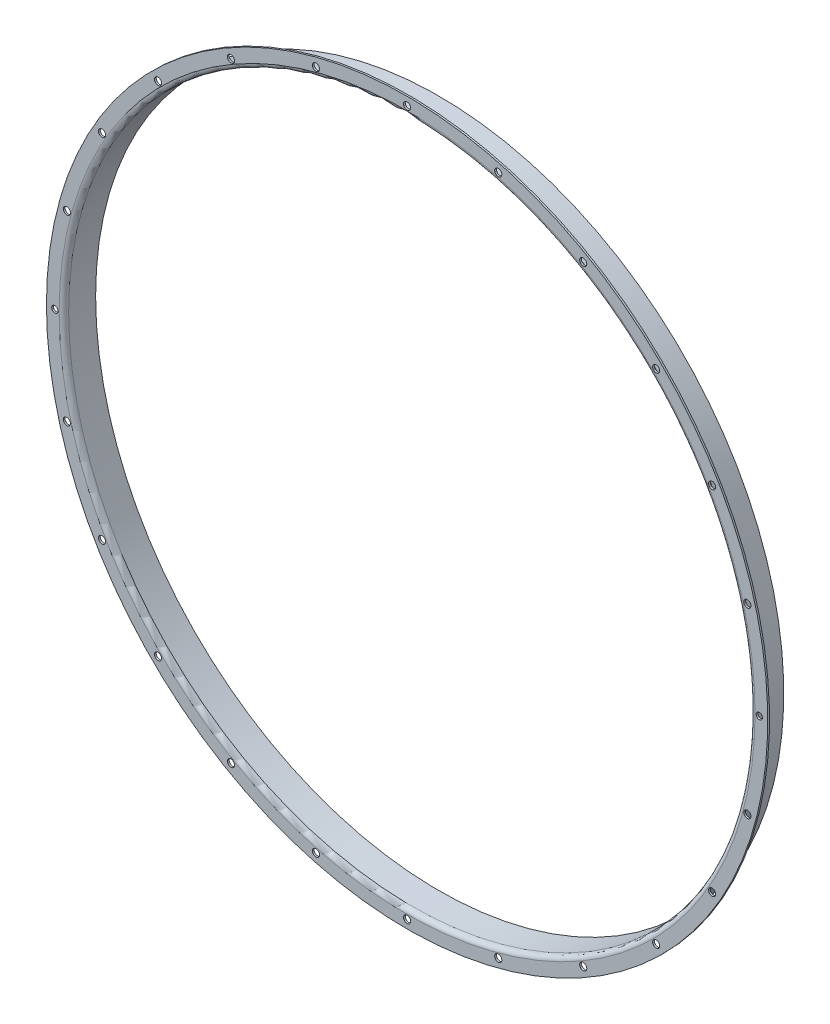
ISO-10303-21;
HEADER;
FILE_DESCRIPTION(('STEP AP214'),'2;1');
FILE_NAME('part.step','',(''),(''),'','','');
FILE_SCHEMA(('AUTOMOTIVE_DESIGN { 1 0 10303 214 1 1 1 1 }'));
ENDSEC;
DATA;
#1=APPLICATION_CONTEXT('core data for automotive mechanical design processes');
#2=APPLICATION_PROTOCOL_DEFINITION('international standard','automotive_design',2000,#1);
#3=PRODUCT_CONTEXT('',#1,'mechanical');
#4=PRODUCT('Part','Part','',(#3));
#5=PRODUCT_RELATED_PRODUCT_CATEGORY('part','',(#4));
#6=PRODUCT_DEFINITION_FORMATION('','',#4);
#7=PRODUCT_DEFINITION_CONTEXT('part definition',#1,'design');
#8=PRODUCT_DEFINITION('design','',#6,#7);
#9=PRODUCT_DEFINITION_SHAPE('','',#8);
#10=(LENGTH_UNIT() NAMED_UNIT(*) SI_UNIT(.MILLI.,.METRE.));
#11=(NAMED_UNIT(*) PLANE_ANGLE_UNIT() SI_UNIT($,.RADIAN.));
#12=(NAMED_UNIT(*) SI_UNIT($,.STERADIAN.) SOLID_ANGLE_UNIT());
#13=UNCERTAINTY_MEASURE_WITH_UNIT(LENGTH_MEASURE(1.E-05),#10,'distance_accuracy_value','');
#14=(GEOMETRIC_REPRESENTATION_CONTEXT(3) GLOBAL_UNCERTAINTY_ASSIGNED_CONTEXT((#13)) GLOBAL_UNIT_ASSIGNED_CONTEXT((#10,
#11,#12)) REPRESENTATION_CONTEXT('',''));
#15=CARTESIAN_POINT('',(0.,0.,0.));
#16=DIRECTION('',(0.,0.,1.));
#17=DIRECTION('',(1.,0.,0.));
#18=AXIS2_PLACEMENT_3D('',#15,#16,#17);
#19=CARTESIAN_POINT('',(0.,0.,0.));
#20=DIRECTION('',(0.,0.,-1.));
#21=DIRECTION('',(-1.,0.,0.));
#22=AXIS2_PLACEMENT_3D('',#19,#20,#21);
#23=CYLINDRICAL_SURFACE('',#22,227.325);
#24=CARTESIAN_POINT('',(0.,0.,0.));
#25=DIRECTION('',(0.,0.,-1.));
#26=DIRECTION('',(-1.,0.,0.));
#27=AXIS2_PLACEMENT_3D('',#24,#25,#26);
#28=CIRCLE('',#27,227.325);
#29=CARTESIAN_POINT('',(-227.325,0.,0.));
#30=VERTEX_POINT('',#29);
#31=EDGE_CURVE('E62',#30,#30,#28,.T.);
#32=ORIENTED_EDGE('',*,*,#31,.T.);
#33=EDGE_LOOP('',(#32));
#34=FACE_BOUND('',#33,.T.);
#35=CARTESIAN_POINT('',(0.,0.,-1.1));
#36=DIRECTION('',(0.,0.,-1.));
#37=DIRECTION('',(-1.,0.,0.));
#38=AXIS2_PLACEMENT_3D('',#35,#36,#37);
#39=CIRCLE('',#38,227.325);
#40=CARTESIAN_POINT('',(-227.325,0.,-1.1));
#41=VERTEX_POINT('',#40);
#42=EDGE_CURVE('E10',#41,#41,#39,.T.);
#43=ORIENTED_EDGE('',*,*,#42,.F.);
#44=EDGE_LOOP('',(#43));
#45=FACE_BOUND('',#44,.T.);
#46=ADVANCED_FACE('F34',(#34,#45),#23,.T.);
#47=CARTESIAN_POINT('',(0.,219.425,-1.1));
#48=DIRECTION('',(0.,0.,-1.));
#49=DIRECTION('',(-1.,0.,0.));
#50=AXIS2_PLACEMENT_3D('',#47,#48,#49);
#51=PLANE('',#50);
#52=CARTESIAN_POINT('',(57.4578280127567,214.435533436174,-1.1));
#53=DIRECTION('',(0.,0.,-1.));
#54=DIRECTION('',(-1.,0.,0.));
#55=AXIS2_PLACEMENT_3D('',#52,#53,#54);
#56=CIRCLE('',#55,2.25);
#57=CARTESIAN_POINT('',(55.2078280127567,214.435533436174,-1.1));
#58=VERTEX_POINT('',#57);
#59=EDGE_CURVE('E191',#58,#58,#56,.T.);
#60=ORIENTED_EDGE('',*,*,#59,.F.);
#61=EDGE_LOOP('',(#60));
#62=FACE_BOUND('',#61,.T.);
#63=CARTESIAN_POINT('',(110.999999999998,192.257639640147,-1.1));
#64=DIRECTION('',(0.,0.,-1.));
#65=DIRECTION('',(-1.,0.,0.));
#66=AXIS2_PLACEMENT_3D('',#63,#64,#65);
#67=CIRCLE('',#66,2.25);
#68=CARTESIAN_POINT('',(108.749999999998,192.257639640147,-1.1));
#69=VERTEX_POINT('',#68);
#70=EDGE_CURVE('E185',#69,#69,#67,.T.);
#71=ORIENTED_EDGE('',*,*,#70,.F.);
#72=EDGE_LOOP('',(#71));
#73=FACE_BOUND('',#72,.T.);
#74=CARTESIAN_POINT('',(156.977705423412,156.977705423415,-1.1));
#75=DIRECTION('',(0.,0.,-1.));
#76=DIRECTION('',(-1.,0.,0.));
#77=AXIS2_PLACEMENT_3D('',#74,#75,#76);
#78=CIRCLE('',#77,2.25);
#79=CARTESIAN_POINT('',(154.727705423412,156.977705423415,-1.1));
#80=VERTEX_POINT('',#79);
#81=EDGE_CURVE('E179',#80,#80,#78,.T.);
#82=ORIENTED_EDGE('',*,*,#81,.F.);
#83=EDGE_LOOP('',(#82));
#84=FACE_BOUND('',#83,.T.);
#85=CARTESIAN_POINT('',(192.257639640144,111.000000000002,-1.1));
#86=DIRECTION('',(0.,0.,-1.));
#87=DIRECTION('',(-1.,0.,0.));
#88=AXIS2_PLACEMENT_3D('',#85,#86,#87);
#89=CIRCLE('',#88,2.25);
#90=CARTESIAN_POINT('',(190.007639640144,111.000000000002,-1.1));
#91=VERTEX_POINT('',#90);
#92=EDGE_CURVE('E173',#91,#91,#89,.T.);
#93=ORIENTED_EDGE('',*,*,#92,.F.);
#94=EDGE_LOOP('',(#93));
#95=FACE_BOUND('',#94,.T.);
#96=CARTESIAN_POINT('',(214.435533436173,57.457828012762,-1.1));
#97=DIRECTION('',(0.,0.,-1.));
#98=DIRECTION('',(-1.,0.,0.));
#99=AXIS2_PLACEMENT_3D('',#96,#97,#98);
#100=CIRCLE('',#99,2.25);
#101=CARTESIAN_POINT('',(212.185533436173,57.457828012762,-1.1));
#102=VERTEX_POINT('',#101);
#103=EDGE_CURVE('E167',#102,#102,#100,.T.);
#104=ORIENTED_EDGE('',*,*,#103,.F.);
#105=EDGE_LOOP('',(#104));
#106=FACE_BOUND('',#105,.T.);
#107=CARTESIAN_POINT('',(214.435533436174,-57.4578280127575,-1.1));
#108=DIRECTION('',(0.,0.,-1.));
#109=DIRECTION('',(-1.,0.,0.));
#110=AXIS2_PLACEMENT_3D('',#107,#108,#109);
#111=CIRCLE('',#110,2.25);
#112=CARTESIAN_POINT('',(212.185533436174,-57.4578280127575,-1.1));
#113=VERTEX_POINT('',#112);
#114=EDGE_CURVE('E161',#113,#113,#111,.T.);
#115=ORIENTED_EDGE('',*,*,#114,.F.);
#116=EDGE_LOOP('',(#115));
#117=FACE_BOUND('',#116,.T.);
#118=CARTESIAN_POINT('',(192.257639640146,-110.999999999998,-1.1));
#119=DIRECTION('',(0.,0.,-1.));
#120=DIRECTION('',(-1.,0.,0.));
#121=AXIS2_PLACEMENT_3D('',#118,#119,#120);
#122=CIRCLE('',#121,2.25);
#123=CARTESIAN_POINT('',(190.007639640146,-110.999999999998,-1.1));
#124=VERTEX_POINT('',#123);
#125=EDGE_CURVE('E155',#124,#124,#122,.T.);
#126=ORIENTED_EDGE('',*,*,#125,.F.);
#127=EDGE_LOOP('',(#126));
#128=FACE_BOUND('',#127,.T.);
#129=CARTESIAN_POINT('',(156.977705423415,-156.977705423412,-1.1));
#130=DIRECTION('',(0.,0.,-1.));
#131=DIRECTION('',(-1.,0.,0.));
#132=AXIS2_PLACEMENT_3D('',#129,#130,#131);
#133=CIRCLE('',#132,2.25);
#134=CARTESIAN_POINT('',(154.727705423415,-156.977705423412,-1.1));
#135=VERTEX_POINT('',#134);
#136=EDGE_CURVE('E149',#135,#135,#133,.T.);
#137=ORIENTED_EDGE('',*,*,#136,.F.);
#138=EDGE_LOOP('',(#137));
#139=FACE_BOUND('',#138,.T.);
#140=CARTESIAN_POINT('',(111.000000000002,-192.257639640144,-1.1));
#141=DIRECTION('',(0.,0.,-1.));
#142=DIRECTION('',(-1.,0.,0.));
#143=AXIS2_PLACEMENT_3D('',#140,#141,#142);
#144=CIRCLE('',#143,2.25);
#145=CARTESIAN_POINT('',(108.750000000002,-192.257639640144,-1.1));
#146=VERTEX_POINT('',#145);
#147=EDGE_CURVE('E143',#146,#146,#144,.T.);
#148=ORIENTED_EDGE('',*,*,#147,.F.);
#149=EDGE_LOOP('',(#148));
#150=FACE_BOUND('',#149,.T.);
#151=CARTESIAN_POINT('',(57.4578280127612,-214.435533436173,-1.1));
#152=DIRECTION('',(0.,0.,-1.));
#153=DIRECTION('',(-1.,0.,0.));
#154=AXIS2_PLACEMENT_3D('',#151,#152,#153);
#155=CIRCLE('',#154,2.25);
#156=CARTESIAN_POINT('',(55.2078280127612,-214.435533436173,-1.1));
#157=VERTEX_POINT('',#156);
#158=EDGE_CURVE('E137',#157,#157,#155,.T.);
#159=ORIENTED_EDGE('',*,*,#158,.F.);
#160=EDGE_LOOP('',(#159));
#161=FACE_BOUND('',#160,.T.);
#162=CARTESIAN_POINT('',(0.,-222.,-1.1));
#163=DIRECTION('',(0.,0.,-1.));
#164=DIRECTION('',(-1.,0.,0.));
#165=AXIS2_PLACEMENT_3D('',#162,#163,#164);
#166=CIRCLE('',#165,2.25);
#167=CARTESIAN_POINT('',(-2.25,-222.,-1.1));
#168=VERTEX_POINT('',#167);
#169=EDGE_CURVE('E131',#168,#168,#166,.T.);
#170=ORIENTED_EDGE('',*,*,#169,.F.);
#171=EDGE_LOOP('',(#170));
#172=FACE_BOUND('',#171,.T.);
#173=CARTESIAN_POINT('',(-57.4578280127582,-214.435533436174,-1.1));
#174=DIRECTION('',(0.,0.,-1.));
#175=DIRECTION('',(-1.,0.,0.));
#176=AXIS2_PLACEMENT_3D('',#173,#174,#175);
#177=CIRCLE('',#176,2.25);
#178=CARTESIAN_POINT('',(-59.7078280127582,-214.435533436174,-1.1));
#179=VERTEX_POINT('',#178);
#180=EDGE_CURVE('E125',#179,#179,#177,.T.);
#181=ORIENTED_EDGE('',*,*,#180,.F.);
#182=EDGE_LOOP('',(#181));
#183=FACE_BOUND('',#182,.T.);
#184=CARTESIAN_POINT('',(-110.999999999999,-192.257639640146,-1.1));
#185=DIRECTION('',(0.,0.,-1.));
#186=DIRECTION('',(-1.,0.,0.));
#187=AXIS2_PLACEMENT_3D('',#184,#185,#186);
#188=CIRCLE('',#187,2.25);
#189=CARTESIAN_POINT('',(-113.249999999999,-192.257639640146,-1.1));
#190=VERTEX_POINT('',#189);
#191=EDGE_CURVE('E119',#190,#190,#188,.T.);
#192=ORIENTED_EDGE('',*,*,#191,.F.);
#193=EDGE_LOOP('',(#192));
#194=FACE_BOUND('',#193,.T.);
#195=CARTESIAN_POINT('',(-156.977705423413,-156.977705423414,-1.1));
#196=DIRECTION('',(0.,0.,-1.));
#197=DIRECTION('',(-1.,0.,0.));
#198=AXIS2_PLACEMENT_3D('',#195,#196,#197);
#199=CIRCLE('',#198,2.25);
#200=CARTESIAN_POINT('',(-159.227705423413,-156.977705423414,-1.1));
#201=VERTEX_POINT('',#200);
#202=EDGE_CURVE('E113',#201,#201,#199,.T.);
#203=ORIENTED_EDGE('',*,*,#202,.F.);
#204=EDGE_LOOP('',(#203));
#205=FACE_BOUND('',#204,.T.);
#206=CARTESIAN_POINT('',(-192.257639640145,-111.000000000001,-1.1));
#207=DIRECTION('',(0.,0.,-1.));
#208=DIRECTION('',(-1.,0.,0.));
#209=AXIS2_PLACEMENT_3D('',#206,#207,#208);
#210=CIRCLE('',#209,2.25);
#211=CARTESIAN_POINT('',(-194.507639640145,-111.000000000001,-1.1));
#212=VERTEX_POINT('',#211);
#213=EDGE_CURVE('E107',#212,#212,#210,.T.);
#214=ORIENTED_EDGE('',*,*,#213,.F.);
#215=EDGE_LOOP('',(#214));
#216=FACE_BOUND('',#215,.T.);
#217=CARTESIAN_POINT('',(-214.435533436173,-57.4578280127605,-1.1));
#218=DIRECTION('',(0.,0.,-1.));
#219=DIRECTION('',(-1.,0.,0.));
#220=AXIS2_PLACEMENT_3D('',#217,#218,#219);
#221=CIRCLE('',#220,2.25);
#222=CARTESIAN_POINT('',(-216.685533436173,-57.4578280127605,-1.1));
#223=VERTEX_POINT('',#222);
#224=EDGE_CURVE('E101',#223,#223,#221,.T.);
#225=ORIENTED_EDGE('',*,*,#224,.F.);
#226=EDGE_LOOP('',(#225));
#227=FACE_BOUND('',#226,.T.);
#228=CARTESIAN_POINT('',(-214.435533436173,57.457828012759,-1.1));
#229=DIRECTION('',(0.,0.,-1.));
#230=DIRECTION('',(-1.,0.,0.));
#231=AXIS2_PLACEMENT_3D('',#228,#229,#230);
#232=CIRCLE('',#231,2.25);
#233=CARTESIAN_POINT('',(-216.685533436173,57.457828012759,-1.1));
#234=VERTEX_POINT('',#233);
#235=EDGE_CURVE('E95',#234,#234,#232,.T.);
#236=ORIENTED_EDGE('',*,*,#235,.F.);
#237=EDGE_LOOP('',(#236));
#238=FACE_BOUND('',#237,.T.);
#239=CARTESIAN_POINT('',(-192.257639640146,111.,-1.1));
#240=DIRECTION('',(0.,0.,-1.));
#241=DIRECTION('',(-1.,0.,0.));
#242=AXIS2_PLACEMENT_3D('',#239,#240,#241);
#243=CIRCLE('',#242,2.25);
#244=CARTESIAN_POINT('',(-194.507639640146,111.,-1.1));
#245=VERTEX_POINT('',#244);
#246=EDGE_CURVE('E89',#245,#245,#243,.T.);
#247=ORIENTED_EDGE('',*,*,#246,.F.);
#248=EDGE_LOOP('',(#247));
#249=FACE_BOUND('',#248,.T.);
#250=CARTESIAN_POINT('',(-156.977705423414,156.977705423413,-1.1));
#251=DIRECTION('',(0.,0.,-1.));
#252=DIRECTION('',(-1.,0.,0.));
#253=AXIS2_PLACEMENT_3D('',#250,#251,#252);
#254=CIRCLE('',#253,2.25);
#255=CARTESIAN_POINT('',(-159.227705423414,156.977705423413,-1.1));
#256=VERTEX_POINT('',#255);
#257=EDGE_CURVE('E83',#256,#256,#254,.T.);
#258=ORIENTED_EDGE('',*,*,#257,.F.);
#259=EDGE_LOOP('',(#258));
#260=FACE_BOUND('',#259,.T.);
#261=CARTESIAN_POINT('',(-111.,192.257639640145,-1.1));
#262=DIRECTION('',(0.,0.,-1.));
#263=DIRECTION('',(-1.,0.,0.));
#264=AXIS2_PLACEMENT_3D('',#261,#262,#263);
#265=CIRCLE('',#264,2.25);
#266=CARTESIAN_POINT('',(-113.25,192.257639640145,-1.1));
#267=VERTEX_POINT('',#266);
#268=EDGE_CURVE('E77',#267,#267,#265,.T.);
#269=ORIENTED_EDGE('',*,*,#268,.F.);
#270=EDGE_LOOP('',(#269));
#271=FACE_BOUND('',#270,.T.);
#272=CARTESIAN_POINT('',(-57.4578280127597,214.435533436173,-1.1));
#273=DIRECTION('',(0.,0.,-1.));
#274=DIRECTION('',(-1.,0.,0.));
#275=AXIS2_PLACEMENT_3D('',#272,#273,#274);
#276=CIRCLE('',#275,2.25);
#277=CARTESIAN_POINT('',(-59.7078280127597,214.435533436173,-1.1));
#278=VERTEX_POINT('',#277);
#279=EDGE_CURVE('E71',#278,#278,#276,.T.);
#280=ORIENTED_EDGE('',*,*,#279,.F.);
#281=EDGE_LOOP('',(#280));
#282=FACE_BOUND('',#281,.T.);
#283=CARTESIAN_POINT('',(0.,222.,-1.1));
#284=DIRECTION('',(0.,0.,-1.));
#285=DIRECTION('',(-1.,0.,0.));
#286=AXIS2_PLACEMENT_3D('',#283,#284,#285);
#287=CIRCLE('',#286,2.25);
#288=CARTESIAN_POINT('',(-2.25,222.,-1.1));
#289=VERTEX_POINT('',#288);
#290=EDGE_CURVE('E65',#289,#289,#287,.T.);
#291=ORIENTED_EDGE('',*,*,#290,.F.);
#292=EDGE_LOOP('',(#291));
#293=FACE_BOUND('',#292,.T.);
#294=ORIENTED_EDGE('',*,*,#42,.T.);
#295=EDGE_LOOP('',(#294));
#296=FACE_BOUND('',#295,.T.);
#297=CARTESIAN_POINT('',(0.,0.,-1.1));
#298=DIRECTION('',(0.,0.,-1.));
#299=DIRECTION('',(-1.,0.,0.));
#300=AXIS2_PLACEMENT_3D('',#297,#298,#299);
#301=CIRCLE('',#300,219.425);
#302=CARTESIAN_POINT('',(-219.425,0.,-1.1));
#303=VERTEX_POINT('',#302);
#304=EDGE_CURVE('E40',#303,#303,#301,.T.);
#305=ORIENTED_EDGE('',*,*,#304,.F.);
#306=EDGE_LOOP('',(#305));
#307=FACE_BOUND('',#306,.T.);
#308=CARTESIAN_POINT('',(-222.,-7.74891763399207E-13,-1.1));
#309=DIRECTION('',(0.,0.,-1.));
#310=DIRECTION('',(-1.,0.,0.));
#311=AXIS2_PLACEMENT_3D('',#308,#309,#310);
#312=CIRCLE('',#311,2.);
#313=CARTESIAN_POINT('',(-224.,-7.74891763399207E-13,-1.1));
#314=VERTEX_POINT('',#313);
#315=EDGE_CURVE('E197',#314,#314,#312,.F.);
#316=ORIENTED_EDGE('',*,*,#315,.T.);
#317=EDGE_LOOP('',(#316));
#318=FACE_BOUND('',#317,.T.);
#319=CARTESIAN_POINT('',(222.,2.32510947784556E-12,-1.1));
#320=DIRECTION('',(0.,0.,-1.));
#321=DIRECTION('',(-1.,0.,0.));
#322=AXIS2_PLACEMENT_3D('',#319,#320,#321);
#323=CIRCLE('',#322,2.);
#324=CARTESIAN_POINT('',(220.,2.32510947784556E-12,-1.1));
#325=VERTEX_POINT('',#324);
#326=EDGE_CURVE('E203',#325,#325,#323,.F.);
#327=ORIENTED_EDGE('',*,*,#326,.T.);
#328=EDGE_LOOP('',(#327));
#329=FACE_BOUND('',#328,.T.);
#330=ADVANCED_FACE('F232',(#62,#73,#84,#95,#106,#117,#128,#139,#150,#161,#172,#183,#194,#205,
#216,#227,#238,#249,#260,#271,#282,#293,#296,#307,#318,#329),#51,.T.);
#331=CARTESIAN_POINT('',(0.,0.,-3.1));
#332=DIRECTION('',(0.,0.,-1.));
#333=DIRECTION('',(-1.,0.,0.));
#334=AXIS2_PLACEMENT_3D('',#331,#332,#333);
#335=TOROIDAL_SURFACE('',#334,219.425,2.);
#336=ORIENTED_EDGE('',*,*,#304,.T.);
#337=EDGE_LOOP('',(#336));
#338=FACE_BOUND('',#337,.T.);
#339=CARTESIAN_POINT('',(0.,0.,-3.1));
#340=DIRECTION('',(0.,0.,-1.));
#341=DIRECTION('',(-1.,0.,0.));
#342=AXIS2_PLACEMENT_3D('',#339,#340,#341);
#343=CIRCLE('',#342,217.425);
#344=CARTESIAN_POINT('',(-217.425,0.,-3.1));
#345=VERTEX_POINT('',#344);
#346=EDGE_CURVE('E44',#345,#345,#343,.T.);
#347=ORIENTED_EDGE('',*,*,#346,.F.);
#348=EDGE_LOOP('',(#347));
#349=FACE_BOUND('',#348,.T.);
#350=ADVANCED_FACE('F237',(#338,#349),#335,.F.);
#351=CARTESIAN_POINT('',(0.,0.,0.));
#352=DIRECTION('',(0.,0.,-1.));
#353=DIRECTION('',(-1.,0.,0.));
#354=AXIS2_PLACEMENT_3D('',#351,#352,#353);
#355=CYLINDRICAL_SURFACE('',#354,217.425);
#356=ORIENTED_EDGE('',*,*,#346,.T.);
#357=EDGE_LOOP('',(#356));
#358=FACE_BOUND('',#357,.T.);
#359=CARTESIAN_POINT('',(0.,0.,-20.));
#360=DIRECTION('',(0.,0.,-1.));
#361=DIRECTION('',(-1.,0.,0.));
#362=AXIS2_PLACEMENT_3D('',#359,#360,#361);
#363=CIRCLE('',#362,217.425);
#364=CARTESIAN_POINT('',(-217.425,0.,-20.));
#365=VERTEX_POINT('',#364);
#366=EDGE_CURVE('E48',#365,#365,#363,.T.);
#367=ORIENTED_EDGE('',*,*,#366,.F.);
#368=EDGE_LOOP('',(#367));
#369=FACE_BOUND('',#368,.T.);
#370=ADVANCED_FACE('F469',(#358,#369),#355,.T.);
#371=CARTESIAN_POINT('',(0.,216.325,-20.));
#372=DIRECTION('',(0.,0.,-1.));
#373=DIRECTION('',(-1.,0.,0.));
#374=AXIS2_PLACEMENT_3D('',#371,#372,#373);
#375=PLANE('',#374);
#376=ORIENTED_EDGE('',*,*,#366,.T.);
#377=EDGE_LOOP('',(#376));
#378=FACE_BOUND('',#377,.T.);
#379=CARTESIAN_POINT('',(0.,0.,-20.));
#380=DIRECTION('',(0.,0.,-1.));
#381=DIRECTION('',(-1.,0.,0.));
#382=AXIS2_PLACEMENT_3D('',#379,#380,#381);
#383=CIRCLE('',#382,216.325);
#384=CARTESIAN_POINT('',(-216.325,0.,-20.));
#385=VERTEX_POINT('',#384);
#386=EDGE_CURVE('E53',#385,#385,#383,.T.);
#387=ORIENTED_EDGE('',*,*,#386,.F.);
#388=EDGE_LOOP('',(#387));
#389=FACE_BOUND('',#388,.T.);
#390=ADVANCED_FACE('F476',(#378,#389),#375,.T.);
#391=CARTESIAN_POINT('',(0.,0.,0.));
#392=DIRECTION('',(0.,0.,-1.));
#393=DIRECTION('',(-1.,0.,0.));
#394=AXIS2_PLACEMENT_3D('',#391,#392,#393);
#395=CYLINDRICAL_SURFACE('',#394,216.325);
#396=ORIENTED_EDGE('',*,*,#386,.T.);
#397=EDGE_LOOP('',(#396));
#398=FACE_BOUND('',#397,.T.);
#399=CARTESIAN_POINT('',(0.,0.,-3.));
#400=DIRECTION('',(0.,0.,-1.));
#401=DIRECTION('',(-1.,0.,0.));
#402=AXIS2_PLACEMENT_3D('',#399,#400,#401);
#403=CIRCLE('',#402,216.325);
#404=CARTESIAN_POINT('',(-216.325,0.,-3.));
#405=VERTEX_POINT('',#404);
#406=EDGE_CURVE('E56',#405,#405,#403,.T.);
#407=ORIENTED_EDGE('',*,*,#406,.F.);
#408=EDGE_LOOP('',(#407));
#409=FACE_BOUND('',#408,.T.);
#410=ADVANCED_FACE('F226',(#398,#409),#395,.F.);
#411=CARTESIAN_POINT('',(0.,0.,-3.));
#412=DIRECTION('',(0.,0.,-1.));
#413=DIRECTION('',(-1.,0.,0.));
#414=AXIS2_PLACEMENT_3D('',#411,#412,#413);
#415=TOROIDAL_SURFACE('',#414,219.325,3.);
#416=ORIENTED_EDGE('',*,*,#406,.T.);
#417=EDGE_LOOP('',(#416));
#418=FACE_BOUND('',#417,.T.);
#419=CARTESIAN_POINT('',(0.,0.,0.));
#420=DIRECTION('',(0.,0.,-1.));
#421=DIRECTION('',(-1.,0.,0.));
#422=AXIS2_PLACEMENT_3D('',#419,#420,#421);
#423=CIRCLE('',#422,219.325);
#424=CARTESIAN_POINT('',(-219.325,0.,0.));
#425=VERTEX_POINT('',#424);
#426=EDGE_CURVE('E59',#425,#425,#423,.T.);
#427=ORIENTED_EDGE('',*,*,#426,.F.);
#428=EDGE_LOOP('',(#427));
#429=FACE_BOUND('',#428,.T.);
#430=ADVANCED_FACE('F216',(#418,#429),#415,.T.);
#431=CARTESIAN_POINT('',(0.,227.325,0.));
#432=DIRECTION('',(0.,0.,1.));
#433=DIRECTION('',(1.,0.,0.));
#434=AXIS2_PLACEMENT_3D('',#431,#432,#433);
#435=PLANE('',#434);
#436=CARTESIAN_POINT('',(57.4578280127567,214.435533436174,0.));
#437=DIRECTION('',(0.,0.,1.));
#438=DIRECTION('',(1.,0.,0.));
#439=AXIS2_PLACEMENT_3D('',#436,#437,#438);
#440=CIRCLE('',#439,2.25);
#441=CARTESIAN_POINT('',(59.7078280127567,214.435533436174,0.));
#442=VERTEX_POINT('',#441);
#443=EDGE_CURVE('E194',#442,#442,#440,.T.);
#444=ORIENTED_EDGE('',*,*,#443,.F.);
#445=EDGE_LOOP('',(#444));
#446=FACE_BOUND('',#445,.T.);
#447=CARTESIAN_POINT('',(110.999999999998,192.257639640147,0.));
#448=DIRECTION('',(0.,0.,1.));
#449=DIRECTION('',(1.,0.,0.));
#450=AXIS2_PLACEMENT_3D('',#447,#448,#449);
#451=CIRCLE('',#450,2.25);
#452=CARTESIAN_POINT('',(113.249999999998,192.257639640147,0.));
#453=VERTEX_POINT('',#452);
#454=EDGE_CURVE('E188',#453,#453,#451,.T.);
#455=ORIENTED_EDGE('',*,*,#454,.F.);
#456=EDGE_LOOP('',(#455));
#457=FACE_BOUND('',#456,.T.);
#458=CARTESIAN_POINT('',(156.977705423412,156.977705423415,0.));
#459=DIRECTION('',(0.,0.,1.));
#460=DIRECTION('',(1.,0.,0.));
#461=AXIS2_PLACEMENT_3D('',#458,#459,#460);
#462=CIRCLE('',#461,2.25);
#463=CARTESIAN_POINT('',(159.227705423412,156.977705423415,0.));
#464=VERTEX_POINT('',#463);
#465=EDGE_CURVE('E182',#464,#464,#462,.T.);
#466=ORIENTED_EDGE('',*,*,#465,.F.);
#467=EDGE_LOOP('',(#466));
#468=FACE_BOUND('',#467,.T.);
#469=CARTESIAN_POINT('',(192.257639640144,111.000000000002,0.));
#470=DIRECTION('',(0.,0.,1.));
#471=DIRECTION('',(1.,0.,0.));
#472=AXIS2_PLACEMENT_3D('',#469,#470,#471);
#473=CIRCLE('',#472,2.25);
#474=CARTESIAN_POINT('',(194.507639640144,111.000000000002,0.));
#475=VERTEX_POINT('',#474);
#476=EDGE_CURVE('E176',#475,#475,#473,.T.);
#477=ORIENTED_EDGE('',*,*,#476,.F.);
#478=EDGE_LOOP('',(#477));
#479=FACE_BOUND('',#478,.T.);
#480=CARTESIAN_POINT('',(214.435533436173,57.457828012762,0.));
#481=DIRECTION('',(0.,0.,1.));
#482=DIRECTION('',(1.,0.,0.));
#483=AXIS2_PLACEMENT_3D('',#480,#481,#482);
#484=CIRCLE('',#483,2.25);
#485=CARTESIAN_POINT('',(216.685533436173,57.457828012762,0.));
#486=VERTEX_POINT('',#485);
#487=EDGE_CURVE('E170',#486,#486,#484,.T.);
#488=ORIENTED_EDGE('',*,*,#487,.F.);
#489=EDGE_LOOP('',(#488));
#490=FACE_BOUND('',#489,.T.);
#491=CARTESIAN_POINT('',(214.435533436174,-57.4578280127575,0.));
#492=DIRECTION('',(0.,0.,1.));
#493=DIRECTION('',(1.,0.,0.));
#494=AXIS2_PLACEMENT_3D('',#491,#492,#493);
#495=CIRCLE('',#494,2.25);
#496=CARTESIAN_POINT('',(216.685533436174,-57.4578280127575,0.));
#497=VERTEX_POINT('',#496);
#498=EDGE_CURVE('E164',#497,#497,#495,.T.);
#499=ORIENTED_EDGE('',*,*,#498,.F.);
#500=EDGE_LOOP('',(#499));
#501=FACE_BOUND('',#500,.T.);
#502=CARTESIAN_POINT('',(192.257639640146,-110.999999999998,0.));
#503=DIRECTION('',(0.,0.,1.));
#504=DIRECTION('',(1.,0.,0.));
#505=AXIS2_PLACEMENT_3D('',#502,#503,#504);
#506=CIRCLE('',#505,2.25);
#507=CARTESIAN_POINT('',(194.507639640146,-110.999999999998,0.));
#508=VERTEX_POINT('',#507);
#509=EDGE_CURVE('E158',#508,#508,#506,.T.);
#510=ORIENTED_EDGE('',*,*,#509,.F.);
#511=EDGE_LOOP('',(#510));
#512=FACE_BOUND('',#511,.T.);
#513=CARTESIAN_POINT('',(156.977705423415,-156.977705423412,0.));
#514=DIRECTION('',(0.,0.,1.));
#515=DIRECTION('',(1.,0.,0.));
#516=AXIS2_PLACEMENT_3D('',#513,#514,#515);
#517=CIRCLE('',#516,2.25);
#518=CARTESIAN_POINT('',(159.227705423415,-156.977705423412,0.));
#519=VERTEX_POINT('',#518);
#520=EDGE_CURVE('E152',#519,#519,#517,.T.);
#521=ORIENTED_EDGE('',*,*,#520,.F.);
#522=EDGE_LOOP('',(#521));
#523=FACE_BOUND('',#522,.T.);
#524=CARTESIAN_POINT('',(111.000000000002,-192.257639640144,0.));
#525=DIRECTION('',(0.,0.,1.));
#526=DIRECTION('',(1.,0.,0.));
#527=AXIS2_PLACEMENT_3D('',#524,#525,#526);
#528=CIRCLE('',#527,2.25);
#529=CARTESIAN_POINT('',(113.250000000002,-192.257639640144,0.));
#530=VERTEX_POINT('',#529);
#531=EDGE_CURVE('E146',#530,#530,#528,.T.);
#532=ORIENTED_EDGE('',*,*,#531,.F.);
#533=EDGE_LOOP('',(#532));
#534=FACE_BOUND('',#533,.T.);
#535=CARTESIAN_POINT('',(57.4578280127612,-214.435533436173,0.));
#536=DIRECTION('',(0.,0.,1.));
#537=DIRECTION('',(1.,0.,0.));
#538=AXIS2_PLACEMENT_3D('',#535,#536,#537);
#539=CIRCLE('',#538,2.25);
#540=CARTESIAN_POINT('',(59.7078280127612,-214.435533436173,0.));
#541=VERTEX_POINT('',#540);
#542=EDGE_CURVE('E140',#541,#541,#539,.T.);
#543=ORIENTED_EDGE('',*,*,#542,.F.);
#544=EDGE_LOOP('',(#543));
#545=FACE_BOUND('',#544,.T.);
#546=CARTESIAN_POINT('',(0.,-222.,0.));
#547=DIRECTION('',(0.,0.,1.));
#548=DIRECTION('',(1.,0.,0.));
#549=AXIS2_PLACEMENT_3D('',#546,#547,#548);
#550=CIRCLE('',#549,2.25);
#551=CARTESIAN_POINT('',(2.25,-222.,0.));
#552=VERTEX_POINT('',#551);
#553=EDGE_CURVE('E134',#552,#552,#550,.T.);
#554=ORIENTED_EDGE('',*,*,#553,.F.);
#555=EDGE_LOOP('',(#554));
#556=FACE_BOUND('',#555,.T.);
#557=CARTESIAN_POINT('',(-57.4578280127582,-214.435533436174,0.));
#558=DIRECTION('',(0.,0.,1.));
#559=DIRECTION('',(1.,0.,0.));
#560=AXIS2_PLACEMENT_3D('',#557,#558,#559);
#561=CIRCLE('',#560,2.25);
#562=CARTESIAN_POINT('',(-55.2078280127582,-214.435533436174,0.));
#563=VERTEX_POINT('',#562);
#564=EDGE_CURVE('E128',#563,#563,#561,.T.);
#565=ORIENTED_EDGE('',*,*,#564,.F.);
#566=EDGE_LOOP('',(#565));
#567=FACE_BOUND('',#566,.T.);
#568=CARTESIAN_POINT('',(-110.999999999999,-192.257639640146,0.));
#569=DIRECTION('',(0.,0.,1.));
#570=DIRECTION('',(1.,0.,0.));
#571=AXIS2_PLACEMENT_3D('',#568,#569,#570);
#572=CIRCLE('',#571,2.25);
#573=CARTESIAN_POINT('',(-108.749999999999,-192.257639640146,0.));
#574=VERTEX_POINT('',#573);
#575=EDGE_CURVE('E122',#574,#574,#572,.T.);
#576=ORIENTED_EDGE('',*,*,#575,.F.);
#577=EDGE_LOOP('',(#576));
#578=FACE_BOUND('',#577,.T.);
#579=CARTESIAN_POINT('',(-156.977705423413,-156.977705423414,0.));
#580=DIRECTION('',(0.,0.,1.));
#581=DIRECTION('',(1.,0.,0.));
#582=AXIS2_PLACEMENT_3D('',#579,#580,#581);
#583=CIRCLE('',#582,2.25);
#584=CARTESIAN_POINT('',(-154.727705423413,-156.977705423414,0.));
#585=VERTEX_POINT('',#584);
#586=EDGE_CURVE('E116',#585,#585,#583,.T.);
#587=ORIENTED_EDGE('',*,*,#586,.F.);
#588=EDGE_LOOP('',(#587));
#589=FACE_BOUND('',#588,.T.);
#590=CARTESIAN_POINT('',(-192.257639640145,-111.000000000001,0.));
#591=DIRECTION('',(0.,0.,1.));
#592=DIRECTION('',(1.,0.,0.));
#593=AXIS2_PLACEMENT_3D('',#590,#591,#592);
#594=CIRCLE('',#593,2.25);
#595=CARTESIAN_POINT('',(-190.007639640145,-111.000000000001,0.));
#596=VERTEX_POINT('',#595);
#597=EDGE_CURVE('E110',#596,#596,#594,.T.);
#598=ORIENTED_EDGE('',*,*,#597,.F.);
#599=EDGE_LOOP('',(#598));
#600=FACE_BOUND('',#599,.T.);
#601=CARTESIAN_POINT('',(-214.435533436173,-57.4578280127605,0.));
#602=DIRECTION('',(0.,0.,1.));
#603=DIRECTION('',(1.,0.,0.));
#604=AXIS2_PLACEMENT_3D('',#601,#602,#603);
#605=CIRCLE('',#604,2.25);
#606=CARTESIAN_POINT('',(-212.185533436173,-57.4578280127605,0.));
#607=VERTEX_POINT('',#606);
#608=EDGE_CURVE('E104',#607,#607,#605,.T.);
#609=ORIENTED_EDGE('',*,*,#608,.F.);
#610=EDGE_LOOP('',(#609));
#611=FACE_BOUND('',#610,.T.);
#612=CARTESIAN_POINT('',(-214.435533436173,57.457828012759,0.));
#613=DIRECTION('',(0.,0.,1.));
#614=DIRECTION('',(1.,0.,0.));
#615=AXIS2_PLACEMENT_3D('',#612,#613,#614);
#616=CIRCLE('',#615,2.25);
#617=CARTESIAN_POINT('',(-212.185533436173,57.457828012759,0.));
#618=VERTEX_POINT('',#617);
#619=EDGE_CURVE('E98',#618,#618,#616,.T.);
#620=ORIENTED_EDGE('',*,*,#619,.F.);
#621=EDGE_LOOP('',(#620));
#622=FACE_BOUND('',#621,.T.);
#623=CARTESIAN_POINT('',(-192.257639640146,111.,0.));
#624=DIRECTION('',(0.,0.,1.));
#625=DIRECTION('',(1.,0.,0.));
#626=AXIS2_PLACEMENT_3D('',#623,#624,#625);
#627=CIRCLE('',#626,2.25);
#628=CARTESIAN_POINT('',(-190.007639640146,111.,0.));
#629=VERTEX_POINT('',#628);
#630=EDGE_CURVE('E92',#629,#629,#627,.T.);
#631=ORIENTED_EDGE('',*,*,#630,.F.);
#632=EDGE_LOOP('',(#631));
#633=FACE_BOUND('',#632,.T.);
#634=CARTESIAN_POINT('',(-156.977705423414,156.977705423413,0.));
#635=DIRECTION('',(0.,0.,1.));
#636=DIRECTION('',(1.,0.,0.));
#637=AXIS2_PLACEMENT_3D('',#634,#635,#636);
#638=CIRCLE('',#637,2.25);
#639=CARTESIAN_POINT('',(-154.727705423414,156.977705423413,0.));
#640=VERTEX_POINT('',#639);
#641=EDGE_CURVE('E86',#640,#640,#638,.T.);
#642=ORIENTED_EDGE('',*,*,#641,.F.);
#643=EDGE_LOOP('',(#642));
#644=FACE_BOUND('',#643,.T.);
#645=CARTESIAN_POINT('',(-111.,192.257639640145,0.));
#646=DIRECTION('',(0.,0.,1.));
#647=DIRECTION('',(1.,0.,0.));
#648=AXIS2_PLACEMENT_3D('',#645,#646,#647);
#649=CIRCLE('',#648,2.25);
#650=CARTESIAN_POINT('',(-108.75,192.257639640145,0.));
#651=VERTEX_POINT('',#650);
#652=EDGE_CURVE('E80',#651,#651,#649,.T.);
#653=ORIENTED_EDGE('',*,*,#652,.F.);
#654=EDGE_LOOP('',(#653));
#655=FACE_BOUND('',#654,.T.);
#656=CARTESIAN_POINT('',(-57.4578280127597,214.435533436173,0.));
#657=DIRECTION('',(0.,0.,1.));
#658=DIRECTION('',(1.,0.,0.));
#659=AXIS2_PLACEMENT_3D('',#656,#657,#658);
#660=CIRCLE('',#659,2.25);
#661=CARTESIAN_POINT('',(-55.2078280127597,214.435533436173,0.));
#662=VERTEX_POINT('',#661);
#663=EDGE_CURVE('E74',#662,#662,#660,.T.);
#664=ORIENTED_EDGE('',*,*,#663,.F.);
#665=EDGE_LOOP('',(#664));
#666=FACE_BOUND('',#665,.T.);
#667=CARTESIAN_POINT('',(0.,222.,0.));
#668=DIRECTION('',(0.,0.,1.));
#669=DIRECTION('',(1.,0.,0.));
#670=AXIS2_PLACEMENT_3D('',#667,#668,#669);
#671=CIRCLE('',#670,2.25);
#672=CARTESIAN_POINT('',(2.25,222.,0.));
#673=VERTEX_POINT('',#672);
#674=EDGE_CURVE('E68',#673,#673,#671,.T.);
#675=ORIENTED_EDGE('',*,*,#674,.F.);
#676=EDGE_LOOP('',(#675));
#677=FACE_BOUND('',#676,.T.);
#678=ORIENTED_EDGE('',*,*,#426,.T.);
#679=EDGE_LOOP('',(#678));
#680=FACE_BOUND('',#679,.T.);
#681=ORIENTED_EDGE('',*,*,#31,.F.);
#682=EDGE_LOOP('',(#681));
#683=FACE_BOUND('',#682,.T.);
#684=CARTESIAN_POINT('',(-222.,-7.74891763399207E-13,0.));
#685=DIRECTION('',(0.,0.,1.));
#686=DIRECTION('',(1.,0.,0.));
#687=AXIS2_PLACEMENT_3D('',#684,#685,#686);
#688=CIRCLE('',#687,2.);
#689=CARTESIAN_POINT('',(-220.,-7.74891763399207E-13,0.));
#690=VERTEX_POINT('',#689);
#691=EDGE_CURVE('E200',#690,#690,#688,.T.);
#692=ORIENTED_EDGE('',*,*,#691,.F.);
#693=EDGE_LOOP('',(#692));
#694=FACE_BOUND('',#693,.T.);
#695=CARTESIAN_POINT('',(222.,2.32510947784556E-12,0.));
#696=DIRECTION('',(0.,0.,1.));
#697=DIRECTION('',(1.,0.,0.));
#698=AXIS2_PLACEMENT_3D('',#695,#696,#697);
#699=CIRCLE('',#698,2.);
#700=CARTESIAN_POINT('',(224.,2.32510947784556E-12,0.));
#701=VERTEX_POINT('',#700);
#702=EDGE_CURVE('E206',#701,#701,#699,.T.);
#703=ORIENTED_EDGE('',*,*,#702,.F.);
#704=EDGE_LOOP('',(#703));
#705=FACE_BOUND('',#704,.T.);
#706=ADVANCED_FACE('F213',(#446,#457,#468,#479,#490,#501,#512,#523,#534,#545,#556,#567,#578,
#589,#600,#611,#622,#633,#644,#655,#666,#677,#680,#683,#694,#705),#435,.T.);
#707=CARTESIAN_POINT('',(0.,222.,0.));
#708=DIRECTION('',(0.,0.,1.));
#709=DIRECTION('',(1.,0.,0.));
#710=AXIS2_PLACEMENT_3D('',#707,#708,#709);
#711=CYLINDRICAL_SURFACE('',#710,2.25);
#712=ORIENTED_EDGE('',*,*,#290,.T.);
#713=EDGE_LOOP('',(#712));
#714=FACE_BOUND('',#713,.T.);
#715=ORIENTED_EDGE('',*,*,#674,.T.);
#716=EDGE_LOOP('',(#715));
#717=FACE_BOUND('',#716,.T.);
#718=ADVANCED_FACE('F215',(#714,#717),#711,.F.);
#719=CARTESIAN_POINT('',(-57.4578280127597,214.435533436173,0.));
#720=DIRECTION('',(0.,0.,1.));
#721=DIRECTION('',(1.,0.,0.));
#722=AXIS2_PLACEMENT_3D('',#719,#720,#721);
#723=CYLINDRICAL_SURFACE('',#722,2.25);
#724=ORIENTED_EDGE('',*,*,#279,.T.);
#725=EDGE_LOOP('',(#724));
#726=FACE_BOUND('',#725,.T.);
#727=ORIENTED_EDGE('',*,*,#663,.T.);
#728=EDGE_LOOP('',(#727));
#729=FACE_BOUND('',#728,.T.);
#730=ADVANCED_FACE('F223',(#726,#729),#723,.F.);
#731=CARTESIAN_POINT('',(-111.,192.257639640145,0.));
#732=DIRECTION('',(0.,0.,1.));
#733=DIRECTION('',(1.,0.,0.));
#734=AXIS2_PLACEMENT_3D('',#731,#732,#733);
#735=CYLINDRICAL_SURFACE('',#734,2.25);
#736=ORIENTED_EDGE('',*,*,#268,.T.);
#737=EDGE_LOOP('',(#736));
#738=FACE_BOUND('',#737,.T.);
#739=ORIENTED_EDGE('',*,*,#652,.T.);
#740=EDGE_LOOP('',(#739));
#741=FACE_BOUND('',#740,.T.);
#742=ADVANCED_FACE('F333',(#738,#741),#735,.F.);
#743=CARTESIAN_POINT('',(-156.977705423414,156.977705423413,0.));
#744=DIRECTION('',(0.,0.,1.));
#745=DIRECTION('',(1.,0.,0.));
#746=AXIS2_PLACEMENT_3D('',#743,#744,#745);
#747=CYLINDRICAL_SURFACE('',#746,2.25);
#748=ORIENTED_EDGE('',*,*,#257,.T.);
#749=EDGE_LOOP('',(#748));
#750=FACE_BOUND('',#749,.T.);
#751=ORIENTED_EDGE('',*,*,#641,.T.);
#752=EDGE_LOOP('',(#751));
#753=FACE_BOUND('',#752,.T.);
#754=ADVANCED_FACE('F329',(#750,#753),#747,.F.);
#755=CARTESIAN_POINT('',(-192.257639640146,111.,0.));
#756=DIRECTION('',(0.,0.,1.));
#757=DIRECTION('',(1.,0.,0.));
#758=AXIS2_PLACEMENT_3D('',#755,#756,#757);
#759=CYLINDRICAL_SURFACE('',#758,2.25);
#760=ORIENTED_EDGE('',*,*,#246,.T.);
#761=EDGE_LOOP('',(#760));
#762=FACE_BOUND('',#761,.T.);
#763=ORIENTED_EDGE('',*,*,#630,.T.);
#764=EDGE_LOOP('',(#763));
#765=FACE_BOUND('',#764,.T.);
#766=ADVANCED_FACE('F325',(#762,#765),#759,.F.);
#767=CARTESIAN_POINT('',(-214.435533436173,57.457828012759,0.));
#768=DIRECTION('',(0.,0.,1.));
#769=DIRECTION('',(1.,0.,0.));
#770=AXIS2_PLACEMENT_3D('',#767,#768,#769);
#771=CYLINDRICAL_SURFACE('',#770,2.25);
#772=ORIENTED_EDGE('',*,*,#235,.T.);
#773=EDGE_LOOP('',(#772));
#774=FACE_BOUND('',#773,.T.);
#775=ORIENTED_EDGE('',*,*,#619,.T.);
#776=EDGE_LOOP('',(#775));
#777=FACE_BOUND('',#776,.T.);
#778=ADVANCED_FACE('F321',(#774,#777),#771,.F.);
#779=CARTESIAN_POINT('',(-214.435533436173,-57.4578280127605,0.));
#780=DIRECTION('',(0.,0.,1.));
#781=DIRECTION('',(1.,0.,0.));
#782=AXIS2_PLACEMENT_3D('',#779,#780,#781);
#783=CYLINDRICAL_SURFACE('',#782,2.25);
#784=ORIENTED_EDGE('',*,*,#224,.T.);
#785=EDGE_LOOP('',(#784));
#786=FACE_BOUND('',#785,.T.);
#787=ORIENTED_EDGE('',*,*,#608,.T.);
#788=EDGE_LOOP('',(#787));
#789=FACE_BOUND('',#788,.T.);
#790=ADVANCED_FACE('F317',(#786,#789),#783,.F.);
#791=CARTESIAN_POINT('',(-192.257639640145,-111.000000000001,0.));
#792=DIRECTION('',(0.,0.,1.));
#793=DIRECTION('',(1.,0.,0.));
#794=AXIS2_PLACEMENT_3D('',#791,#792,#793);
#795=CYLINDRICAL_SURFACE('',#794,2.25);
#796=ORIENTED_EDGE('',*,*,#213,.T.);
#797=EDGE_LOOP('',(#796));
#798=FACE_BOUND('',#797,.T.);
#799=ORIENTED_EDGE('',*,*,#597,.T.);
#800=EDGE_LOOP('',(#799));
#801=FACE_BOUND('',#800,.T.);
#802=ADVANCED_FACE('F313',(#798,#801),#795,.F.);
#803=CARTESIAN_POINT('',(-156.977705423413,-156.977705423414,0.));
#804=DIRECTION('',(0.,0.,1.));
#805=DIRECTION('',(1.,0.,0.));
#806=AXIS2_PLACEMENT_3D('',#803,#804,#805);
#807=CYLINDRICAL_SURFACE('',#806,2.25);
#808=ORIENTED_EDGE('',*,*,#202,.T.);
#809=EDGE_LOOP('',(#808));
#810=FACE_BOUND('',#809,.T.);
#811=ORIENTED_EDGE('',*,*,#586,.T.);
#812=EDGE_LOOP('',(#811));
#813=FACE_BOUND('',#812,.T.);
#814=ADVANCED_FACE('F309',(#810,#813),#807,.F.);
#815=CARTESIAN_POINT('',(-110.999999999999,-192.257639640146,0.));
#816=DIRECTION('',(0.,0.,1.));
#817=DIRECTION('',(1.,0.,0.));
#818=AXIS2_PLACEMENT_3D('',#815,#816,#817);
#819=CYLINDRICAL_SURFACE('',#818,2.25);
#820=ORIENTED_EDGE('',*,*,#191,.T.);
#821=EDGE_LOOP('',(#820));
#822=FACE_BOUND('',#821,.T.);
#823=ORIENTED_EDGE('',*,*,#575,.T.);
#824=EDGE_LOOP('',(#823));
#825=FACE_BOUND('',#824,.T.);
#826=ADVANCED_FACE('F305',(#822,#825),#819,.F.);
#827=CARTESIAN_POINT('',(-57.4578280127582,-214.435533436174,0.));
#828=DIRECTION('',(0.,0.,1.));
#829=DIRECTION('',(1.,0.,0.));
#830=AXIS2_PLACEMENT_3D('',#827,#828,#829);
#831=CYLINDRICAL_SURFACE('',#830,2.25);
#832=ORIENTED_EDGE('',*,*,#180,.T.);
#833=EDGE_LOOP('',(#832));
#834=FACE_BOUND('',#833,.T.);
#835=ORIENTED_EDGE('',*,*,#564,.T.);
#836=EDGE_LOOP('',(#835));
#837=FACE_BOUND('',#836,.T.);
#838=ADVANCED_FACE('F301',(#834,#837),#831,.F.);
#839=CARTESIAN_POINT('',(0.,-222.,0.));
#840=DIRECTION('',(0.,0.,1.));
#841=DIRECTION('',(1.,0.,0.));
#842=AXIS2_PLACEMENT_3D('',#839,#840,#841);
#843=CYLINDRICAL_SURFACE('',#842,2.25);
#844=ORIENTED_EDGE('',*,*,#169,.T.);
#845=EDGE_LOOP('',(#844));
#846=FACE_BOUND('',#845,.T.);
#847=ORIENTED_EDGE('',*,*,#553,.T.);
#848=EDGE_LOOP('',(#847));
#849=FACE_BOUND('',#848,.T.);
#850=ADVANCED_FACE('F297',(#846,#849),#843,.F.);
#851=CARTESIAN_POINT('',(57.4578280127612,-214.435533436173,0.));
#852=DIRECTION('',(0.,0.,1.));
#853=DIRECTION('',(1.,0.,0.));
#854=AXIS2_PLACEMENT_3D('',#851,#852,#853);
#855=CYLINDRICAL_SURFACE('',#854,2.25);
#856=ORIENTED_EDGE('',*,*,#158,.T.);
#857=EDGE_LOOP('',(#856));
#858=FACE_BOUND('',#857,.T.);
#859=ORIENTED_EDGE('',*,*,#542,.T.);
#860=EDGE_LOOP('',(#859));
#861=FACE_BOUND('',#860,.T.);
#862=ADVANCED_FACE('F293',(#858,#861),#855,.F.);
#863=CARTESIAN_POINT('',(111.000000000002,-192.257639640144,0.));
#864=DIRECTION('',(0.,0.,1.));
#865=DIRECTION('',(1.,0.,0.));
#866=AXIS2_PLACEMENT_3D('',#863,#864,#865);
#867=CYLINDRICAL_SURFACE('',#866,2.25);
#868=ORIENTED_EDGE('',*,*,#147,.T.);
#869=EDGE_LOOP('',(#868));
#870=FACE_BOUND('',#869,.T.);
#871=ORIENTED_EDGE('',*,*,#531,.T.);
#872=EDGE_LOOP('',(#871));
#873=FACE_BOUND('',#872,.T.);
#874=ADVANCED_FACE('F289',(#870,#873),#867,.F.);
#875=CARTESIAN_POINT('',(156.977705423415,-156.977705423412,0.));
#876=DIRECTION('',(0.,0.,1.));
#877=DIRECTION('',(1.,0.,0.));
#878=AXIS2_PLACEMENT_3D('',#875,#876,#877);
#879=CYLINDRICAL_SURFACE('',#878,2.25);
#880=ORIENTED_EDGE('',*,*,#136,.T.);
#881=EDGE_LOOP('',(#880));
#882=FACE_BOUND('',#881,.T.);
#883=ORIENTED_EDGE('',*,*,#520,.T.);
#884=EDGE_LOOP('',(#883));
#885=FACE_BOUND('',#884,.T.);
#886=ADVANCED_FACE('F285',(#882,#885),#879,.F.);
#887=CARTESIAN_POINT('',(192.257639640146,-110.999999999998,0.));
#888=DIRECTION('',(0.,0.,1.));
#889=DIRECTION('',(1.,0.,0.));
#890=AXIS2_PLACEMENT_3D('',#887,#888,#889);
#891=CYLINDRICAL_SURFACE('',#890,2.25);
#892=ORIENTED_EDGE('',*,*,#125,.T.);
#893=EDGE_LOOP('',(#892));
#894=FACE_BOUND('',#893,.T.);
#895=ORIENTED_EDGE('',*,*,#509,.T.);
#896=EDGE_LOOP('',(#895));
#897=FACE_BOUND('',#896,.T.);
#898=ADVANCED_FACE('F281',(#894,#897),#891,.F.);
#899=CARTESIAN_POINT('',(214.435533436174,-57.4578280127575,0.));
#900=DIRECTION('',(0.,0.,1.));
#901=DIRECTION('',(1.,0.,0.));
#902=AXIS2_PLACEMENT_3D('',#899,#900,#901);
#903=CYLINDRICAL_SURFACE('',#902,2.25);
#904=ORIENTED_EDGE('',*,*,#114,.T.);
#905=EDGE_LOOP('',(#904));
#906=FACE_BOUND('',#905,.T.);
#907=ORIENTED_EDGE('',*,*,#498,.T.);
#908=EDGE_LOOP('',(#907));
#909=FACE_BOUND('',#908,.T.);
#910=ADVANCED_FACE('F277',(#906,#909),#903,.F.);
#911=CARTESIAN_POINT('',(214.435533436173,57.457828012762,0.));
#912=DIRECTION('',(0.,0.,1.));
#913=DIRECTION('',(1.,0.,0.));
#914=AXIS2_PLACEMENT_3D('',#911,#912,#913);
#915=CYLINDRICAL_SURFACE('',#914,2.25);
#916=ORIENTED_EDGE('',*,*,#103,.T.);
#917=EDGE_LOOP('',(#916));
#918=FACE_BOUND('',#917,.T.);
#919=ORIENTED_EDGE('',*,*,#487,.T.);
#920=EDGE_LOOP('',(#919));
#921=FACE_BOUND('',#920,.T.);
#922=ADVANCED_FACE('F273',(#918,#921),#915,.F.);
#923=CARTESIAN_POINT('',(192.257639640144,111.000000000002,0.));
#924=DIRECTION('',(0.,0.,1.));
#925=DIRECTION('',(1.,0.,0.));
#926=AXIS2_PLACEMENT_3D('',#923,#924,#925);
#927=CYLINDRICAL_SURFACE('',#926,2.25);
#928=ORIENTED_EDGE('',*,*,#92,.T.);
#929=EDGE_LOOP('',(#928));
#930=FACE_BOUND('',#929,.T.);
#931=ORIENTED_EDGE('',*,*,#476,.T.);
#932=EDGE_LOOP('',(#931));
#933=FACE_BOUND('',#932,.T.);
#934=ADVANCED_FACE('F269',(#930,#933),#927,.F.);
#935=CARTESIAN_POINT('',(156.977705423412,156.977705423415,0.));
#936=DIRECTION('',(0.,0.,1.));
#937=DIRECTION('',(1.,0.,0.));
#938=AXIS2_PLACEMENT_3D('',#935,#936,#937);
#939=CYLINDRICAL_SURFACE('',#938,2.25);
#940=ORIENTED_EDGE('',*,*,#81,.T.);
#941=EDGE_LOOP('',(#940));
#942=FACE_BOUND('',#941,.T.);
#943=ORIENTED_EDGE('',*,*,#465,.T.);
#944=EDGE_LOOP('',(#943));
#945=FACE_BOUND('',#944,.T.);
#946=ADVANCED_FACE('F265',(#942,#945),#939,.F.);
#947=CARTESIAN_POINT('',(110.999999999998,192.257639640147,0.));
#948=DIRECTION('',(0.,0.,1.));
#949=DIRECTION('',(1.,0.,0.));
#950=AXIS2_PLACEMENT_3D('',#947,#948,#949);
#951=CYLINDRICAL_SURFACE('',#950,2.25);
#952=ORIENTED_EDGE('',*,*,#70,.T.);
#953=EDGE_LOOP('',(#952));
#954=FACE_BOUND('',#953,.T.);
#955=ORIENTED_EDGE('',*,*,#454,.T.);
#956=EDGE_LOOP('',(#955));
#957=FACE_BOUND('',#956,.T.);
#958=ADVANCED_FACE('F261',(#954,#957),#951,.F.);
#959=CARTESIAN_POINT('',(57.4578280127567,214.435533436174,0.));
#960=DIRECTION('',(0.,0.,1.));
#961=DIRECTION('',(1.,0.,0.));
#962=AXIS2_PLACEMENT_3D('',#959,#960,#961);
#963=CYLINDRICAL_SURFACE('',#962,2.25);
#964=ORIENTED_EDGE('',*,*,#59,.T.);
#965=EDGE_LOOP('',(#964));
#966=FACE_BOUND('',#965,.T.);
#967=ORIENTED_EDGE('',*,*,#443,.T.);
#968=EDGE_LOOP('',(#967));
#969=FACE_BOUND('',#968,.T.);
#970=ADVANCED_FACE('F248',(#966,#969),#963,.F.);
#971=CARTESIAN_POINT('',(-222.,-7.74891763399207E-13,-7.46396103067894));
#972=DIRECTION('',(0.,0.,1.));
#973=DIRECTION('',(1.,0.,0.));
#974=AXIS2_PLACEMENT_3D('',#971,#972,#973);
#975=CYLINDRICAL_SURFACE('',#974,2.);
#976=ORIENTED_EDGE('',*,*,#691,.T.);
#977=EDGE_LOOP('',(#976));
#978=FACE_BOUND('',#977,.T.);
#979=ORIENTED_EDGE('',*,*,#315,.F.);
#980=EDGE_LOOP('',(#979));
#981=FACE_BOUND('',#980,.T.);
#982=ADVANCED_FACE('F245',(#978,#981),#975,.F.);
#983=CARTESIAN_POINT('',(222.,2.32510947784556E-12,-7.46396103067894));
#984=DIRECTION('',(0.,0.,1.));
#985=DIRECTION('',(1.,0.,0.));
#986=AXIS2_PLACEMENT_3D('',#983,#984,#985);
#987=CYLINDRICAL_SURFACE('',#986,2.);
#988=ORIENTED_EDGE('',*,*,#702,.T.);
#989=EDGE_LOOP('',(#988));
#990=FACE_BOUND('',#989,.T.);
#991=ORIENTED_EDGE('',*,*,#326,.F.);
#992=EDGE_LOOP('',(#991));
#993=FACE_BOUND('',#992,.T.);
#994=ADVANCED_FACE('F210',(#990,#993),#987,.F.);
#995=CLOSED_SHELL('',(#46,#330,#350,#370,#390,#410,#430,#706,#718,#730,#742,#754,#766,#778,#790,
#802,#814,#826,#838,#850,#862,#874,#886,#898,#910,#922,#934,#946,#958,#970,#982,#994));
#996=MANIFOLD_SOLID_BREP('B2',#995);
#997=ADVANCED_BREP_SHAPE_REPRESENTATION('',(#18,#996),#14);
#998=SHAPE_DEFINITION_REPRESENTATION(#9,#997);
ENDSEC;
END-ISO-10303-21;
